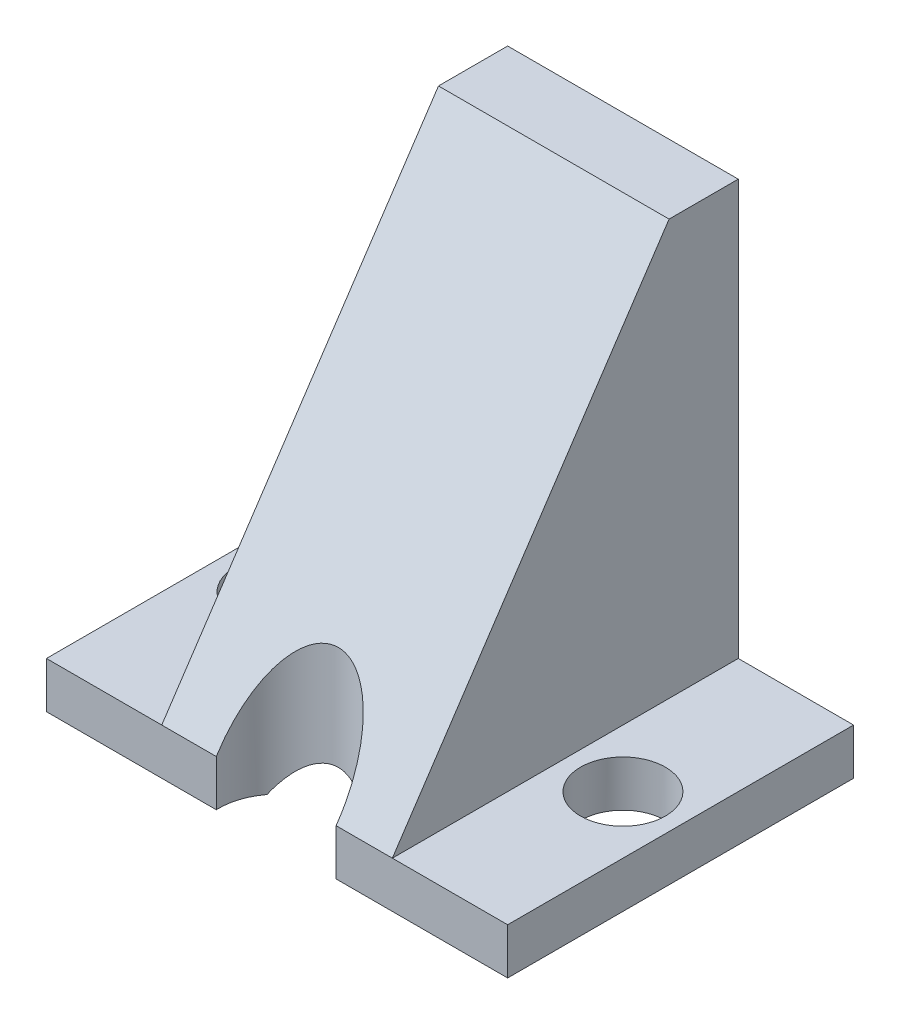
ISO-10303-21;
HEADER;
FILE_DESCRIPTION(('STEP AP214'),'2;1');
FILE_NAME('part.step','',(''),(''),'','','');
FILE_SCHEMA(('AUTOMOTIVE_DESIGN { 1 0 10303 214 1 1 1 1 }'));
ENDSEC;
DATA;
#1=APPLICATION_CONTEXT('core data for automotive mechanical design processes');
#2=APPLICATION_PROTOCOL_DEFINITION('international standard','automotive_design',2000,#1);
#3=PRODUCT_CONTEXT('',#1,'mechanical');
#4=PRODUCT('Part','Part','',(#3));
#5=PRODUCT_RELATED_PRODUCT_CATEGORY('part','',(#4));
#6=PRODUCT_DEFINITION_FORMATION('','',#4);
#7=PRODUCT_DEFINITION_CONTEXT('part definition',#1,'design');
#8=PRODUCT_DEFINITION('design','',#6,#7);
#9=PRODUCT_DEFINITION_SHAPE('','',#8);
#10=(LENGTH_UNIT() NAMED_UNIT(*) SI_UNIT(.MILLI.,.METRE.));
#11=(NAMED_UNIT(*) PLANE_ANGLE_UNIT() SI_UNIT($,.RADIAN.));
#12=(NAMED_UNIT(*) SI_UNIT($,.STERADIAN.) SOLID_ANGLE_UNIT());
#13=UNCERTAINTY_MEASURE_WITH_UNIT(LENGTH_MEASURE(1.E-05),#10,'distance_accuracy_value','');
#14=(GEOMETRIC_REPRESENTATION_CONTEXT(3) GLOBAL_UNCERTAINTY_ASSIGNED_CONTEXT((#13)) GLOBAL_UNIT_ASSIGNED_CONTEXT((#10,
#11,#12)) REPRESENTATION_CONTEXT('',''));
#15=CARTESIAN_POINT('',(0.,0.,0.));
#16=DIRECTION('',(0.,0.,1.));
#17=DIRECTION('',(1.,0.,0.));
#18=AXIS2_PLACEMENT_3D('',#15,#16,#17);
#19=CARTESIAN_POINT('',(0.,25.4,0.));
#20=DIRECTION('',(0.,0.,-1.));
#21=DIRECTION('',(-1.,0.,0.));
#22=AXIS2_PLACEMENT_3D('',#19,#20,#21);
#23=PLANE('',#22);
#24=DIRECTION('',(-1.,0.,0.));
#25=VECTOR('',#24,1.);
#26=CARTESIAN_POINT('',(0.,2.53999999999988,0.));
#27=LINE('',#26,#25);
#28=CARTESIAN_POINT('',(19.05,2.53999999999988,0.));
#29=VERTEX_POINT('',#28);
#30=CARTESIAN_POINT('',(15.952277256323,2.53999999999988,0.));
#31=VERTEX_POINT('',#30);
#32=EDGE_CURVE('E233',#29,#31,#27,.T.);
#33=ORIENTED_EDGE('',*,*,#32,.T.);
#34=DIRECTION('',(0.,-1.,0.));
#35=VECTOR('',#34,1.);
#36=CARTESIAN_POINT('',(15.952277256323,25.4,0.));
#37=LINE('',#36,#35);
#38=CARTESIAN_POINT('',(15.952277256323,0.,0.));
#39=VERTEX_POINT('',#38);
#40=EDGE_CURVE('E303',#31,#39,#37,.T.);
#41=ORIENTED_EDGE('',*,*,#40,.T.);
#42=DIRECTION('',(1.,0.,0.));
#43=VECTOR('',#42,1.);
#44=CARTESIAN_POINT('',(0.,0.,0.));
#45=LINE('',#44,#43);
#46=CARTESIAN_POINT('',(25.4,0.,0.));
#47=VERTEX_POINT('',#46);
#48=EDGE_CURVE('E154',#39,#47,#45,.T.);
#49=ORIENTED_EDGE('',*,*,#48,.T.);
#50=DIRECTION('',(0.,-1.,0.));
#51=VECTOR('',#50,1.);
#52=CARTESIAN_POINT('',(25.4,25.4,0.));
#53=LINE('',#52,#51);
#54=CARTESIAN_POINT('',(25.4,2.54,0.));
#55=VERTEX_POINT('',#54);
#56=EDGE_CURVE('E217',#55,#47,#53,.T.);
#57=ORIENTED_EDGE('',*,*,#56,.F.);
#58=EDGE_CURVE('E229',#55,#29,#27,.T.);
#59=ORIENTED_EDGE('',*,*,#58,.T.);
#60=EDGE_LOOP('',(#33,#41,#49,#57,#59));
#61=FACE_BOUND('',#60,.T.);
#62=ADVANCED_FACE('F41',(#61),#23,.F.);
#63=CARTESIAN_POINT('',(0.,0.,0.));
#64=DIRECTION('',(0.,-1.,0.));
#65=DIRECTION('',(0.,0.,-1.));
#66=AXIS2_PLACEMENT_3D('',#63,#64,#65);
#67=PLANE('',#66);
#68=CARTESIAN_POINT('',(12.652625,0.,-0.124494928982553));
#69=DIRECTION('',(0.,-1.,0.));
#70=DIRECTION('',(0.,0.,-1.));
#71=AXIS2_PLACEMENT_3D('',#68,#69,#70);
#72=CIRCLE('',#71,3.302);
#73=CARTESIAN_POINT('',(15.2815055288479,0.,-2.12254176653281));
#74=VERTEX_POINT('',#73);
#75=EDGE_CURVE('E143',#74,#39,#72,.T.);
#76=ORIENTED_EDGE('',*,*,#75,.F.);
#77=DIRECTION('',(-1.,0.,0.));
#78=VECTOR('',#77,1.);
#79=CARTESIAN_POINT('',(0.,0.,-2.12254176653281));
#80=LINE('',#79,#78);
#81=CARTESIAN_POINT('',(17.526,0.,-2.12254176653281));
#82=VERTEX_POINT('',#81);
#83=EDGE_CURVE('E152',#82,#74,#80,.T.);
#84=ORIENTED_EDGE('',*,*,#83,.F.);
#85=DIRECTION('',(0.,0.,1.));
#86=VECTOR('',#85,1.);
#87=CARTESIAN_POINT('',(17.526,0.,0.));
#88=LINE('',#87,#86);
#89=CARTESIAN_POINT('',(17.526,0.,-19.05));
#90=VERTEX_POINT('',#89);
#91=EDGE_CURVE('E160',#90,#82,#88,.T.);
#92=ORIENTED_EDGE('',*,*,#91,.F.);
#93=DIRECTION('',(-1.,0.,0.));
#94=VECTOR('',#93,1.);
#95=CARTESIAN_POINT('',(0.,0.,-19.05));
#96=LINE('',#95,#94);
#97=CARTESIAN_POINT('',(25.4,0.,-19.05));
#98=VERTEX_POINT('',#97);
#99=EDGE_CURVE('E199',#98,#90,#96,.T.);
#100=ORIENTED_EDGE('',*,*,#99,.F.);
#101=DIRECTION('',(0.,0.,-1.));
#102=VECTOR('',#101,1.);
#103=CARTESIAN_POINT('',(25.4,0.,0.));
#104=LINE('',#103,#102);
#105=EDGE_CURVE('E200',#47,#98,#104,.T.);
#106=ORIENTED_EDGE('',*,*,#105,.F.);
#107=ORIENTED_EDGE('',*,*,#48,.F.);
#108=EDGE_LOOP('',(#76,#84,#92,#100,#106,#107));
#109=FACE_BOUND('',#108,.T.);
#110=CARTESIAN_POINT('',(22.225,0.,-9.525));
#111=DIRECTION('',(0.,-1.,0.));
#112=DIRECTION('',(0.,0.,-1.));
#113=AXIS2_PLACEMENT_3D('',#110,#111,#112);
#114=CIRCLE('',#113,2.3368);
#115=CARTESIAN_POINT('',(22.225,0.,-11.8618));
#116=VERTEX_POINT('',#115);
#117=EDGE_CURVE('E318',#116,#116,#114,.T.);
#118=ORIENTED_EDGE('',*,*,#117,.F.);
#119=EDGE_LOOP('',(#118));
#120=FACE_BOUND('',#119,.T.);
#121=ADVANCED_FACE('F149',(#109,#120),#67,.T.);
#122=CARTESIAN_POINT('',(0.,25.4,0.));
#123=DIRECTION('',(1.,0.,0.));
#124=DIRECTION('',(0.,0.,-1.));
#125=AXIS2_PLACEMENT_3D('',#122,#123,#124);
#126=PLANE('',#125);
#127=DIRECTION('',(0.,0.,1.));
#128=VECTOR('',#127,1.);
#129=CARTESIAN_POINT('',(0.,2.54,-19.05));
#130=LINE('',#129,#128);
#131=CARTESIAN_POINT('',(0.,2.54,-19.05));
#132=VERTEX_POINT('',#131);
#133=CARTESIAN_POINT('',(0.,2.53999999999988,0.));
#134=VERTEX_POINT('',#133);
#135=EDGE_CURVE('E280',#132,#134,#130,.T.);
#136=ORIENTED_EDGE('',*,*,#135,.F.);
#137=DIRECTION('',(0.,-1.,0.));
#138=VECTOR('',#137,1.);
#139=CARTESIAN_POINT('',(0.,25.4,-19.05));
#140=LINE('',#139,#138);
#141=CARTESIAN_POINT('',(0.,0.,-19.05));
#142=VERTEX_POINT('',#141);
#143=EDGE_CURVE('E211',#132,#142,#140,.T.);
#144=ORIENTED_EDGE('',*,*,#143,.T.);
#145=DIRECTION('',(0.,0.,1.));
#146=VECTOR('',#145,1.);
#147=CARTESIAN_POINT('',(0.,0.,0.));
#148=LINE('',#147,#146);
#149=CARTESIAN_POINT('',(0.,0.,0.));
#150=VERTEX_POINT('',#149);
#151=EDGE_CURVE('E197',#142,#150,#148,.T.);
#152=ORIENTED_EDGE('',*,*,#151,.T.);
#153=DIRECTION('',(0.,-1.,0.));
#154=VECTOR('',#153,1.);
#155=CARTESIAN_POINT('',(0.,25.4,0.));
#156=LINE('',#155,#154);
#157=EDGE_CURVE('E221',#134,#150,#156,.T.);
#158=ORIENTED_EDGE('',*,*,#157,.F.);
#159=EDGE_LOOP('',(#136,#144,#152,#158));
#160=FACE_BOUND('',#159,.T.);
#161=ADVANCED_FACE('F352',(#160),#126,.F.);
#162=CARTESIAN_POINT('',(25.4,25.4,0.));
#163=DIRECTION('',(-1.,0.,0.));
#164=DIRECTION('',(0.,0.,1.));
#165=AXIS2_PLACEMENT_3D('',#162,#163,#164);
#166=PLANE('',#165);
#167=DIRECTION('',(0.,0.,-1.));
#168=VECTOR('',#167,1.);
#169=CARTESIAN_POINT('',(25.4,2.54,-19.05));
#170=LINE('',#169,#168);
#171=CARTESIAN_POINT('',(25.4,2.54,-19.05));
#172=VERTEX_POINT('',#171);
#173=EDGE_CURVE('E261',#55,#172,#170,.T.);
#174=ORIENTED_EDGE('',*,*,#173,.F.);
#175=ORIENTED_EDGE('',*,*,#56,.T.);
#176=ORIENTED_EDGE('',*,*,#105,.T.);
#177=DIRECTION('',(0.,-1.,0.));
#178=VECTOR('',#177,1.);
#179=CARTESIAN_POINT('',(25.4,25.4,-19.05));
#180=LINE('',#179,#178);
#181=EDGE_CURVE('E214',#172,#98,#180,.T.);
#182=ORIENTED_EDGE('',*,*,#181,.F.);
#183=EDGE_LOOP('',(#174,#175,#176,#182));
#184=FACE_BOUND('',#183,.T.);
#185=ADVANCED_FACE('F265',(#184),#166,.F.);
#186=CARTESIAN_POINT('',(9.35297274367698,0.,0.));
#187=VERTEX_POINT('',#186);
#188=EDGE_CURVE('E207',#150,#187,#45,.T.);
#189=ORIENTED_EDGE('',*,*,#188,.T.);
#190=DIRECTION('',(0.,-1.,0.));
#191=VECTOR('',#190,1.);
#192=CARTESIAN_POINT('',(9.35297274367698,25.4,0.));
#193=LINE('',#192,#191);
#194=CARTESIAN_POINT('',(9.35297274367698,2.53999999999988,0.));
#195=VERTEX_POINT('',#194);
#196=EDGE_CURVE('E306',#187,#195,#193,.F.);
#197=ORIENTED_EDGE('',*,*,#196,.T.);
#198=CARTESIAN_POINT('',(6.35,2.54,0.));
#199=VERTEX_POINT('',#198);
#200=EDGE_CURVE('E234',#195,#199,#27,.T.);
#201=ORIENTED_EDGE('',*,*,#200,.T.);
#202=EDGE_CURVE('E228',#199,#134,#27,.T.);
#203=ORIENTED_EDGE('',*,*,#202,.T.);
#204=ORIENTED_EDGE('',*,*,#157,.T.);
#205=EDGE_LOOP('',(#189,#197,#201,#203,#204));
#206=FACE_BOUND('',#205,.T.);
#207=ADVANCED_FACE('F348',(#206),#23,.F.);
#208=CARTESIAN_POINT('',(0.,25.4,-19.05));
#209=DIRECTION('',(0.,0.,1.));
#210=DIRECTION('',(1.,0.,0.));
#211=AXIS2_PLACEMENT_3D('',#208,#209,#210);
#212=PLANE('',#211);
#213=DIRECTION('',(-1.,0.,0.));
#214=VECTOR('',#213,1.);
#215=CARTESIAN_POINT('',(0.,25.3911873502009,-19.05));
#216=LINE('',#215,#214);
#217=CARTESIAN_POINT('',(17.526,25.3911873502009,-19.05));
#218=VERTEX_POINT('',#217);
#219=CARTESIAN_POINT('',(7.874,25.3911873502009,-19.05));
#220=VERTEX_POINT('',#219);
#221=EDGE_CURVE('E187',#218,#220,#216,.T.);
#222=ORIENTED_EDGE('',*,*,#221,.T.);
#223=DIRECTION('',(0.,-1.,0.));
#224=VECTOR('',#223,1.);
#225=CARTESIAN_POINT('',(7.874,25.4,-19.05));
#226=LINE('',#225,#224);
#227=CARTESIAN_POINT('',(7.87400000000001,0.,-19.05));
#228=VERTEX_POINT('',#227);
#229=EDGE_CURVE('E175',#220,#228,#226,.T.);
#230=ORIENTED_EDGE('',*,*,#229,.T.);
#231=EDGE_CURVE('E184',#228,#142,#96,.T.);
#232=ORIENTED_EDGE('',*,*,#231,.T.);
#233=ORIENTED_EDGE('',*,*,#143,.F.);
#234=DIRECTION('',(-1.,0.,0.));
#235=VECTOR('',#234,1.);
#236=CARTESIAN_POINT('',(0.,2.54,-19.05));
#237=LINE('',#236,#235);
#238=CARTESIAN_POINT('',(6.35,2.54,-19.05));
#239=VERTEX_POINT('',#238);
#240=EDGE_CURVE('E286',#239,#132,#237,.T.);
#241=ORIENTED_EDGE('',*,*,#240,.F.);
#242=DIRECTION('',(0.,1.,0.));
#243=VECTOR('',#242,1.);
#244=CARTESIAN_POINT('',(6.35,2.54,-19.05));
#245=LINE('',#244,#243);
#246=CARTESIAN_POINT('',(6.35,25.4,-19.05));
#247=VERTEX_POINT('',#246);
#248=EDGE_CURVE('E277',#239,#247,#245,.T.);
#249=ORIENTED_EDGE('',*,*,#248,.T.);
#250=DIRECTION('',(-1.,0.,0.));
#251=VECTOR('',#250,1.);
#252=CARTESIAN_POINT('',(0.,25.4,-19.05));
#253=LINE('',#252,#251);
#254=CARTESIAN_POINT('',(19.05,25.4,-19.05));
#255=VERTEX_POINT('',#254);
#256=EDGE_CURVE('E205',#255,#247,#253,.T.);
#257=ORIENTED_EDGE('',*,*,#256,.F.);
#258=DIRECTION('',(0.,1.,0.));
#259=VECTOR('',#258,1.);
#260=CARTESIAN_POINT('',(19.05,2.54,-19.05));
#261=LINE('',#260,#259);
#262=CARTESIAN_POINT('',(19.05,2.54,-19.05));
#263=VERTEX_POINT('',#262);
#264=EDGE_CURVE('E271',#263,#255,#261,.T.);
#265=ORIENTED_EDGE('',*,*,#264,.F.);
#266=DIRECTION('',(-1.,0.,0.));
#267=VECTOR('',#266,1.);
#268=CARTESIAN_POINT('',(19.05,2.54,-19.05));
#269=LINE('',#268,#267);
#270=EDGE_CURVE('E267',#172,#263,#269,.T.);
#271=ORIENTED_EDGE('',*,*,#270,.F.);
#272=ORIENTED_EDGE('',*,*,#181,.T.);
#273=ORIENTED_EDGE('',*,*,#99,.T.);
#274=DIRECTION('',(0.,1.,0.));
#275=VECTOR('',#274,1.);
#276=CARTESIAN_POINT('',(17.526,25.4,-19.05));
#277=LINE('',#276,#275);
#278=EDGE_CURVE('E190',#90,#218,#277,.T.);
#279=ORIENTED_EDGE('',*,*,#278,.T.);
#280=EDGE_LOOP('',(#222,#230,#232,#233,#241,#249,#257,#265,#271,#272,#273,#279));
#281=FACE_BOUND('',#280,.T.);
#282=ADVANCED_FACE('F182',(#281),#212,.F.);
#283=CARTESIAN_POINT('',(0.,25.4,0.));
#284=DIRECTION('',(0.,-1.,0.));
#285=DIRECTION('',(0.,0.,-1.));
#286=AXIS2_PLACEMENT_3D('',#283,#284,#285);
#287=PLANE('',#286);
#288=DIRECTION('',(1.,0.,0.));
#289=VECTOR('',#288,1.);
#290=CARTESIAN_POINT('',(0.,25.4,-15.24));
#291=LINE('',#290,#289);
#292=CARTESIAN_POINT('',(6.35,25.4,-15.24));
#293=VERTEX_POINT('',#292);
#294=CARTESIAN_POINT('',(19.05,25.4,-15.24));
#295=VERTEX_POINT('',#294);
#296=EDGE_CURVE('E224',#293,#295,#291,.T.);
#297=ORIENTED_EDGE('',*,*,#296,.T.);
#298=DIRECTION('',(0.,0.,1.));
#299=VECTOR('',#298,1.);
#300=CARTESIAN_POINT('',(19.05,25.4,-19.05));
#301=LINE('',#300,#299);
#302=EDGE_CURVE('E249',#255,#295,#301,.T.);
#303=ORIENTED_EDGE('',*,*,#302,.F.);
#304=ORIENTED_EDGE('',*,*,#256,.T.);
#305=DIRECTION('',(0.,0.,-1.));
#306=VECTOR('',#305,1.);
#307=CARTESIAN_POINT('',(6.35,25.4,-19.05));
#308=LINE('',#307,#306);
#309=EDGE_CURVE('E189',#293,#247,#308,.T.);
#310=ORIENTED_EDGE('',*,*,#309,.F.);
#311=EDGE_LOOP('',(#297,#303,#304,#310));
#312=FACE_BOUND('',#311,.T.);
#313=ADVANCED_FACE('F360',(#312),#287,.F.);
#314=CARTESIAN_POINT('',(10.0237444711521,0.,-2.12254176653281));
#315=VERTEX_POINT('',#314);
#316=EDGE_CURVE('E58',#187,#315,#72,.T.);
#317=ORIENTED_EDGE('',*,*,#316,.F.);
#318=ORIENTED_EDGE('',*,*,#188,.F.);
#319=ORIENTED_EDGE('',*,*,#151,.F.);
#320=ORIENTED_EDGE('',*,*,#231,.F.);
#321=DIRECTION('',(0.,0.,-1.));
#322=VECTOR('',#321,1.);
#323=CARTESIAN_POINT('',(7.87400000000001,0.,0.));
#324=LINE('',#323,#322);
#325=CARTESIAN_POINT('',(7.87400000000001,0.,-2.12254176653281));
#326=VERTEX_POINT('',#325);
#327=EDGE_CURVE('E51',#326,#228,#324,.T.);
#328=ORIENTED_EDGE('',*,*,#327,.F.);
#329=EDGE_CURVE('E161',#315,#326,#80,.T.);
#330=ORIENTED_EDGE('',*,*,#329,.F.);
#331=EDGE_LOOP('',(#317,#318,#319,#320,#328,#330));
#332=FACE_BOUND('',#331,.T.);
#333=CARTESIAN_POINT('',(3.175,0.,-9.525));
#334=DIRECTION('',(0.,-1.,0.));
#335=DIRECTION('',(0.,0.,-1.));
#336=AXIS2_PLACEMENT_3D('',#333,#334,#335);
#337=CIRCLE('',#336,2.3368);
#338=CARTESIAN_POINT('',(3.175,0.,-11.8618));
#339=VERTEX_POINT('',#338);
#340=EDGE_CURVE('E323',#339,#339,#337,.T.);
#341=ORIENTED_EDGE('',*,*,#340,.F.);
#342=EDGE_LOOP('',(#341));
#343=FACE_BOUND('',#342,.T.);
#344=ADVANCED_FACE('F193',(#332,#343),#67,.T.);
#345=CARTESIAN_POINT('',(0.,25.4,-15.24));
#346=DIRECTION('',(0.,-0.554700196225228,-0.832050294337844));
#347=DIRECTION('',(1.,0.,0.));
#348=AXIS2_PLACEMENT_3D('',#345,#346,#347);
#349=PLANE('',#348);
#350=CARTESIAN_POINT('',(12.652625,2.72674239347371,-0.124494928982553));
#351=DIRECTION('',(0.,-0.554700196225228,-0.832050294337844));
#352=DIRECTION('',(0.,-0.832050294337844,0.554700196225228));
#353=AXIS2_PLACEMENT_3D('',#350,#351,#352);
#354=ELLIPSE('',#353,5.95276515579106,3.302);
#355=EDGE_CURVE('E156',#31,#195,#354,.F.);
#356=ORIENTED_EDGE('',*,*,#355,.F.);
#357=ORIENTED_EDGE('',*,*,#32,.F.);
#358=DIRECTION('',(0.,0.832050294337844,-0.554700196225228));
#359=VECTOR('',#358,1.);
#360=CARTESIAN_POINT('',(19.05,25.4,-15.24));
#361=LINE('',#360,#359);
#362=EDGE_CURVE('E166',#295,#29,#361,.F.);
#363=ORIENTED_EDGE('',*,*,#362,.F.);
#364=ORIENTED_EDGE('',*,*,#296,.F.);
#365=DIRECTION('',(0.,-0.832050294337844,0.554700196225228));
#366=VECTOR('',#365,1.);
#367=CARTESIAN_POINT('',(6.35,25.4,-15.24));
#368=LINE('',#367,#366);
#369=EDGE_CURVE('E232',#199,#293,#368,.F.);
#370=ORIENTED_EDGE('',*,*,#369,.F.);
#371=ORIENTED_EDGE('',*,*,#200,.F.);
#372=EDGE_LOOP('',(#356,#357,#363,#364,#370,#371));
#373=FACE_BOUND('',#372,.T.);
#374=ADVANCED_FACE('F44',(#373),#349,.F.);
#375=CARTESIAN_POINT('',(6.35,2.54,-19.05));
#376=DIRECTION('',(1.,0.,0.));
#377=DIRECTION('',(0.,0.,-1.));
#378=AXIS2_PLACEMENT_3D('',#375,#376,#377);
#379=PLANE('',#378);
#380=ORIENTED_EDGE('',*,*,#369,.T.);
#381=ORIENTED_EDGE('',*,*,#309,.T.);
#382=ORIENTED_EDGE('',*,*,#248,.F.);
#383=DIRECTION('',(0.,0.,-1.));
#384=VECTOR('',#383,1.);
#385=CARTESIAN_POINT('',(6.35,2.54,-19.05));
#386=LINE('',#385,#384);
#387=EDGE_CURVE('E283',#199,#239,#386,.T.);
#388=ORIENTED_EDGE('',*,*,#387,.F.);
#389=EDGE_LOOP('',(#380,#381,#382,#388));
#390=FACE_BOUND('',#389,.T.);
#391=ADVANCED_FACE('F371',(#390),#379,.F.);
#392=CARTESIAN_POINT('',(0.,2.54,0.));
#393=DIRECTION('',(0.,1.,0.));
#394=DIRECTION('',(0.,0.,1.));
#395=AXIS2_PLACEMENT_3D('',#392,#393,#394);
#396=PLANE('',#395);
#397=CARTESIAN_POINT('',(3.175,2.54,-9.525));
#398=DIRECTION('',(0.,1.,0.));
#399=DIRECTION('',(0.,0.,1.));
#400=AXIS2_PLACEMENT_3D('',#397,#398,#399);
#401=CIRCLE('',#400,2.3368);
#402=CARTESIAN_POINT('',(3.175,2.54,-7.1882));
#403=VERTEX_POINT('',#402);
#404=EDGE_CURVE('E311',#403,#403,#401,.T.);
#405=ORIENTED_EDGE('',*,*,#404,.F.);
#406=EDGE_LOOP('',(#405));
#407=FACE_BOUND('',#406,.T.);
#408=ORIENTED_EDGE('',*,*,#387,.T.);
#409=ORIENTED_EDGE('',*,*,#240,.T.);
#410=ORIENTED_EDGE('',*,*,#135,.T.);
#411=ORIENTED_EDGE('',*,*,#202,.F.);
#412=EDGE_LOOP('',(#408,#409,#410,#411));
#413=FACE_BOUND('',#412,.T.);
#414=ADVANCED_FACE('F374',(#407,#413),#396,.T.);
#415=CARTESIAN_POINT('',(19.05,2.54,-19.05));
#416=DIRECTION('',(-1.,0.,0.));
#417=DIRECTION('',(0.,0.,1.));
#418=AXIS2_PLACEMENT_3D('',#415,#416,#417);
#419=PLANE('',#418);
#420=ORIENTED_EDGE('',*,*,#362,.T.);
#421=DIRECTION('',(0.,0.,1.));
#422=VECTOR('',#421,1.);
#423=CARTESIAN_POINT('',(19.05,2.54,-19.05));
#424=LINE('',#423,#422);
#425=EDGE_CURVE('E246',#263,#29,#424,.T.);
#426=ORIENTED_EDGE('',*,*,#425,.F.);
#427=ORIENTED_EDGE('',*,*,#264,.T.);
#428=ORIENTED_EDGE('',*,*,#302,.T.);
#429=EDGE_LOOP('',(#420,#426,#427,#428));
#430=FACE_BOUND('',#429,.T.);
#431=ADVANCED_FACE('F245',(#430),#419,.F.);
#432=CARTESIAN_POINT('',(0.,2.54,0.));
#433=DIRECTION('',(0.,1.,0.));
#434=DIRECTION('',(0.,0.,1.));
#435=AXIS2_PLACEMENT_3D('',#432,#433,#434);
#436=PLANE('',#435);
#437=CARTESIAN_POINT('',(22.225,2.54,-9.525));
#438=DIRECTION('',(0.,1.,0.));
#439=DIRECTION('',(0.,0.,1.));
#440=AXIS2_PLACEMENT_3D('',#437,#438,#439);
#441=CIRCLE('',#440,2.3368);
#442=CARTESIAN_POINT('',(22.225,2.54,-7.1882));
#443=VERTEX_POINT('',#442);
#444=EDGE_CURVE('E305',#443,#443,#441,.T.);
#445=ORIENTED_EDGE('',*,*,#444,.F.);
#446=EDGE_LOOP('',(#445));
#447=FACE_BOUND('',#446,.T.);
#448=ORIENTED_EDGE('',*,*,#173,.T.);
#449=ORIENTED_EDGE('',*,*,#270,.T.);
#450=ORIENTED_EDGE('',*,*,#425,.T.);
#451=ORIENTED_EDGE('',*,*,#58,.F.);
#452=EDGE_LOOP('',(#448,#449,#450,#451));
#453=FACE_BOUND('',#452,.T.);
#454=ADVANCED_FACE('F260',(#447,#453),#436,.T.);
#455=CARTESIAN_POINT('',(7.874,14.8997403656077,-39.5300027293068));
#456=DIRECTION('',(-1.,0.,0.));
#457=DIRECTION('',(0.,-1.,0.));
#458=AXIS2_PLACEMENT_3D('',#455,#456,#457);
#459=PLANE('',#458);
#460=DIRECTION('',(0.,-0.832050294337844,0.554700196225228));
#461=VECTOR('',#460,1.);
#462=CARTESIAN_POINT('',(7.874,27.5801868513164,-20.5093330007437));
#463=LINE('',#462,#461);
#464=EDGE_CURVE('E177',#220,#326,#463,.T.);
#465=ORIENTED_EDGE('',*,*,#464,.T.);
#466=ORIENTED_EDGE('',*,*,#327,.T.);
#467=ORIENTED_EDGE('',*,*,#229,.F.);
#468=EDGE_LOOP('',(#465,#466,#467));
#469=FACE_BOUND('',#468,.T.);
#470=ADVANCED_FACE('F174',(#469),#459,.F.);
#471=CARTESIAN_POINT('',(17.526,14.8997403656077,-39.5300027293068));
#472=DIRECTION('',(1.,0.,0.));
#473=DIRECTION('',(0.,1.,0.));
#474=AXIS2_PLACEMENT_3D('',#471,#472,#473);
#475=PLANE('',#474);
#476=ORIENTED_EDGE('',*,*,#91,.T.);
#477=DIRECTION('',(0.,0.832050294337844,-0.554700196225228));
#478=VECTOR('',#477,1.);
#479=CARTESIAN_POINT('',(17.526,27.5801868513164,-20.5093330007437));
#480=LINE('',#479,#478);
#481=EDGE_CURVE('E65',#82,#218,#480,.T.);
#482=ORIENTED_EDGE('',*,*,#481,.T.);
#483=ORIENTED_EDGE('',*,*,#278,.F.);
#484=EDGE_LOOP('',(#476,#482,#483));
#485=FACE_BOUND('',#484,.T.);
#486=ADVANCED_FACE('F336',(#485),#475,.F.);
#487=CARTESIAN_POINT('',(0.,-0.97963466147668,-1.46945199221502));
#488=DIRECTION('',(0.,0.554700196225228,0.832050294337845));
#489=DIRECTION('',(0.,-0.832050294337844,0.554700196225228));
#490=AXIS2_PLACEMENT_3D('',#487,#488,#489);
#491=PLANE('',#490);
#492=ORIENTED_EDGE('',*,*,#83,.T.);
#493=CARTESIAN_POINT('',(12.652625,-2.99707025632539,-0.124494928982553));
#494=DIRECTION('',(0.,0.554700196225228,0.832050294337845));
#495=DIRECTION('',(0.,-0.832050294337844,0.554700196225228));
#496=AXIS2_PLACEMENT_3D('',#493,#494,#495);
#497=ELLIPSE('',#496,5.95276515579106,3.302);
#498=EDGE_CURVE('E11',#74,#315,#497,.T.);
#499=ORIENTED_EDGE('',*,*,#498,.T.);
#500=ORIENTED_EDGE('',*,*,#329,.T.);
#501=ORIENTED_EDGE('',*,*,#464,.F.);
#502=ORIENTED_EDGE('',*,*,#221,.F.);
#503=ORIENTED_EDGE('',*,*,#481,.F.);
#504=EDGE_LOOP('',(#492,#499,#500,#501,#502,#503));
#505=FACE_BOUND('',#504,.T.);
#506=ADVANCED_FACE('F158',(#505),#491,.F.);
#507=CARTESIAN_POINT('',(22.225,-20.32,-9.525));
#508=DIRECTION('',(0.,1.,0.));
#509=DIRECTION('',(0.,0.,1.));
#510=AXIS2_PLACEMENT_3D('',#507,#508,#509);
#511=CYLINDRICAL_SURFACE('',#510,2.3368);
#512=ORIENTED_EDGE('',*,*,#117,.T.);
#513=EDGE_LOOP('',(#512));
#514=FACE_BOUND('',#513,.T.);
#515=ORIENTED_EDGE('',*,*,#444,.T.);
#516=EDGE_LOOP('',(#515));
#517=FACE_BOUND('',#516,.T.);
#518=ADVANCED_FACE('F343',(#514,#517),#511,.F.);
#519=CARTESIAN_POINT('',(3.175,-20.32,-9.525));
#520=DIRECTION('',(0.,1.,0.));
#521=DIRECTION('',(0.,0.,1.));
#522=AXIS2_PLACEMENT_3D('',#519,#520,#521);
#523=CYLINDRICAL_SURFACE('',#522,2.3368);
#524=ORIENTED_EDGE('',*,*,#340,.T.);
#525=EDGE_LOOP('',(#524));
#526=FACE_BOUND('',#525,.T.);
#527=ORIENTED_EDGE('',*,*,#404,.T.);
#528=EDGE_LOOP('',(#527));
#529=FACE_BOUND('',#528,.T.);
#530=ADVANCED_FACE('F387',(#526,#529),#523,.F.);
#531=CARTESIAN_POINT('',(12.652625,25.4,-0.124494928982553));
#532=DIRECTION('',(0.,-1.,0.));
#533=DIRECTION('',(0.,0.,-1.));
#534=AXIS2_PLACEMENT_3D('',#531,#532,#533);
#535=CYLINDRICAL_SURFACE('',#534,3.302);
#536=ORIENTED_EDGE('',*,*,#355,.T.);
#537=ORIENTED_EDGE('',*,*,#196,.F.);
#538=ORIENTED_EDGE('',*,*,#316,.T.);
#539=ORIENTED_EDGE('',*,*,#498,.F.);
#540=ORIENTED_EDGE('',*,*,#75,.T.);
#541=ORIENTED_EDGE('',*,*,#40,.F.);
#542=EDGE_LOOP('',(#536,#537,#538,#539,#540,#541));
#543=FACE_BOUND('',#542,.T.);
#544=ADVANCED_FACE('F142',(#543),#535,.F.);
#545=CLOSED_SHELL('',(#62,#121,#161,#185,#207,#282,#313,#344,#374,#391,#414,#431,#454,#470,#486,
#506,#518,#530,#544));
#546=MANIFOLD_SOLID_BREP('B2',#545);
#547=ADVANCED_BREP_SHAPE_REPRESENTATION('',(#18,#546),#14);
#548=SHAPE_DEFINITION_REPRESENTATION(#9,#547);
ENDSEC;
END-ISO-10303-21;
